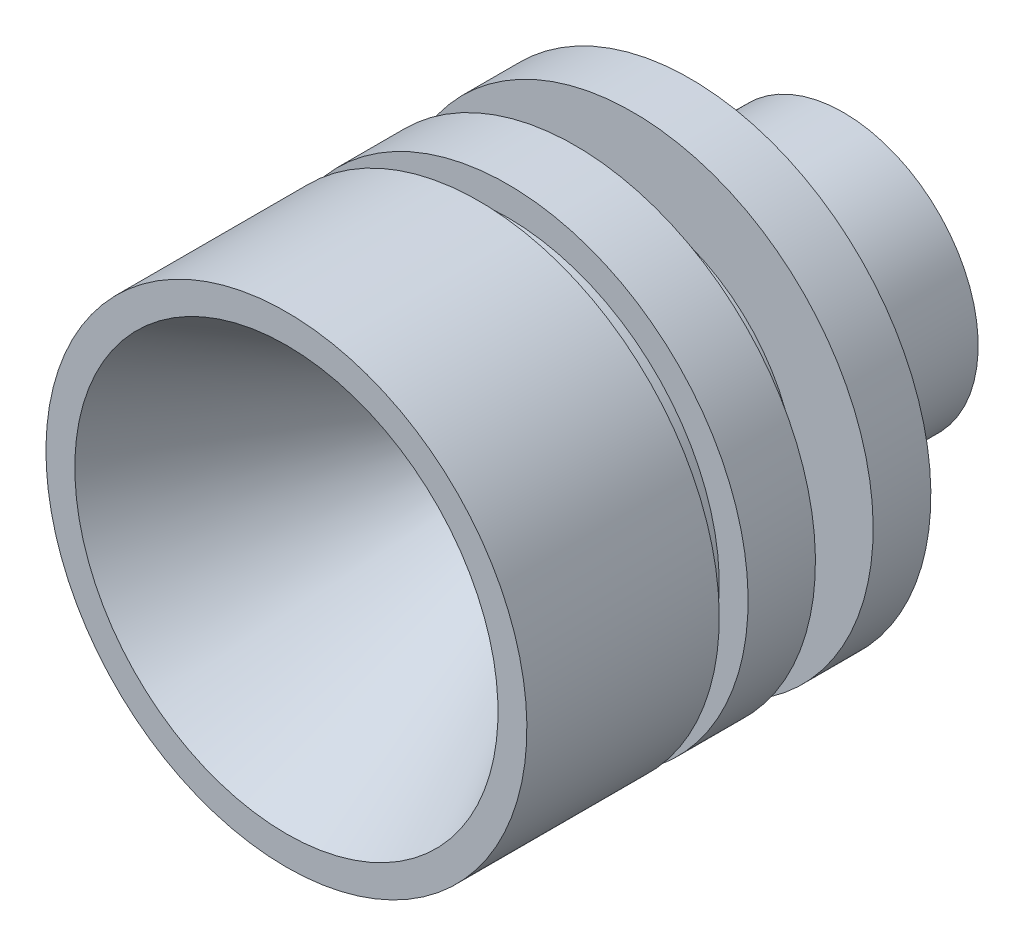
ISO-10303-21;
HEADER;
FILE_DESCRIPTION(('STEP AP214'),'2;1');
FILE_NAME('part.step','',(''),(''),'','','');
FILE_SCHEMA(('AUTOMOTIVE_DESIGN { 1 0 10303 214 1 1 1 1 }'));
ENDSEC;
DATA;
#1=APPLICATION_CONTEXT('core data for automotive mechanical design processes');
#2=APPLICATION_PROTOCOL_DEFINITION('international standard','automotive_design',2000,#1);
#3=PRODUCT_CONTEXT('',#1,'mechanical');
#4=PRODUCT('Part','Part','',(#3));
#5=PRODUCT_RELATED_PRODUCT_CATEGORY('part','',(#4));
#6=PRODUCT_DEFINITION_FORMATION('','',#4);
#7=PRODUCT_DEFINITION_CONTEXT('part definition',#1,'design');
#8=PRODUCT_DEFINITION('design','',#6,#7);
#9=PRODUCT_DEFINITION_SHAPE('','',#8);
#10=(LENGTH_UNIT() NAMED_UNIT(*) SI_UNIT(.MILLI.,.METRE.));
#11=(NAMED_UNIT(*) PLANE_ANGLE_UNIT() SI_UNIT($,.RADIAN.));
#12=(NAMED_UNIT(*) SI_UNIT($,.STERADIAN.) SOLID_ANGLE_UNIT());
#13=UNCERTAINTY_MEASURE_WITH_UNIT(LENGTH_MEASURE(1.E-05),#10,'distance_accuracy_value','');
#14=(GEOMETRIC_REPRESENTATION_CONTEXT(3) GLOBAL_UNCERTAINTY_ASSIGNED_CONTEXT((#13)) GLOBAL_UNIT_ASSIGNED_CONTEXT((#10,
#11,#12)) REPRESENTATION_CONTEXT('',''));
#15=CARTESIAN_POINT('',(0.,0.,0.));
#16=DIRECTION('',(0.,0.,1.));
#17=DIRECTION('',(1.,0.,0.));
#18=AXIS2_PLACEMENT_3D('',#15,#16,#17);
#19=CARTESIAN_POINT('',(0.,12.5,14.4796013855391));
#20=DIRECTION('',(0.,0.,-1.));
#21=DIRECTION('',(0.,1.,0.));
#22=AXIS2_PLACEMENT_3D('',#19,#20,#21);
#23=PLANE('',#22);
#24=CARTESIAN_POINT('',(0.,0.,14.4796013855391));
#25=DIRECTION('',(0.,0.,1.));
#26=DIRECTION('',(0.,-1.,0.));
#27=AXIS2_PLACEMENT_3D('',#24,#25,#26);
#28=CIRCLE('',#27,11.);
#29=CARTESIAN_POINT('',(0.,-11.,14.4796013855391));
#30=VERTEX_POINT('',#29);
#31=EDGE_CURVE('E10',#30,#30,#28,.T.);
#32=ORIENTED_EDGE('',*,*,#31,.F.);
#33=EDGE_LOOP('',(#32));
#34=FACE_BOUND('',#33,.T.);
#35=CARTESIAN_POINT('',(0.,0.,14.4796013855391));
#36=DIRECTION('',(0.,0.,1.));
#37=DIRECTION('',(0.,-1.,0.));
#38=AXIS2_PLACEMENT_3D('',#35,#36,#37);
#39=CIRCLE('',#38,12.5);
#40=CARTESIAN_POINT('',(0.,-12.5,14.4796013855391));
#41=VERTEX_POINT('',#40);
#42=EDGE_CURVE('E81',#41,#41,#39,.T.);
#43=ORIENTED_EDGE('',*,*,#42,.T.);
#44=EDGE_LOOP('',(#43));
#45=FACE_BOUND('',#44,.T.);
#46=ADVANCED_FACE('F32',(#34,#45),#23,.F.);
#47=CARTESIAN_POINT('',(0.,0.,14.4796013855391));
#48=DIRECTION('',(0.,0.,1.));
#49=DIRECTION('',(0.,-1.,0.));
#50=AXIS2_PLACEMENT_3D('',#47,#48,#49);
#51=CONICAL_SURFACE('',#50,11.,0.5235987755983);
#52=CARTESIAN_POINT('',(0.,0.,-1.54186858447295));
#53=DIRECTION('',(0.,0.,1.));
#54=DIRECTION('',(0.,-1.,0.));
#55=AXIS2_PLACEMENT_3D('',#52,#53,#54);
#56=CIRCLE('',#55,1.75);
#57=CARTESIAN_POINT('',(0.,-1.75,-1.54186858447295));
#58=VERTEX_POINT('',#57);
#59=EDGE_CURVE('E38',#58,#58,#56,.T.);
#60=ORIENTED_EDGE('',*,*,#59,.F.);
#61=EDGE_LOOP('',(#60));
#62=FACE_BOUND('',#61,.T.);
#63=ORIENTED_EDGE('',*,*,#31,.T.);
#64=EDGE_LOOP('',(#63));
#65=FACE_BOUND('',#64,.T.);
#66=ADVANCED_FACE('F160',(#62,#65),#51,.F.);
#67=CARTESIAN_POINT('',(0.,0.,-1.54186858447295));
#68=DIRECTION('',(0.,0.,-1.));
#69=DIRECTION('',(0.,1.,0.));
#70=AXIS2_PLACEMENT_3D('',#67,#68,#69);
#71=CONICAL_SURFACE('',#70,1.75,0.209439510239313);
#72=CARTESIAN_POINT('',(0.,0.,-14.4796013855391));
#73=DIRECTION('',(0.,0.,1.));
#74=DIRECTION('',(0.,-1.,0.));
#75=AXIS2_PLACEMENT_3D('',#72,#73,#74);
#76=CIRCLE('',#75,4.5);
#77=CARTESIAN_POINT('',(0.,-4.5,-14.4796013855391));
#78=VERTEX_POINT('',#77);
#79=EDGE_CURVE('E42',#78,#78,#76,.T.);
#80=ORIENTED_EDGE('',*,*,#79,.F.);
#81=EDGE_LOOP('',(#80));
#82=FACE_BOUND('',#81,.T.);
#83=ORIENTED_EDGE('',*,*,#59,.T.);
#84=EDGE_LOOP('',(#83));
#85=FACE_BOUND('',#84,.T.);
#86=ADVANCED_FACE('F155',(#82,#85),#71,.F.);
#87=CARTESIAN_POINT('',(0.,7.,-14.4796013855391));
#88=DIRECTION('',(0.,0.,1.));
#89=DIRECTION('',(0.,-1.,0.));
#90=AXIS2_PLACEMENT_3D('',#87,#88,#89);
#91=PLANE('',#90);
#92=CARTESIAN_POINT('',(0.,0.,-14.4796013855391));
#93=DIRECTION('',(0.,0.,1.));
#94=DIRECTION('',(0.,-1.,0.));
#95=AXIS2_PLACEMENT_3D('',#92,#93,#94);
#96=CIRCLE('',#95,7.);
#97=CARTESIAN_POINT('',(0.,-7.,-14.4796013855391));
#98=VERTEX_POINT('',#97);
#99=EDGE_CURVE('E46',#98,#98,#96,.T.);
#100=ORIENTED_EDGE('',*,*,#99,.F.);
#101=EDGE_LOOP('',(#100));
#102=FACE_BOUND('',#101,.T.);
#103=ORIENTED_EDGE('',*,*,#79,.T.);
#104=EDGE_LOOP('',(#103));
#105=FACE_BOUND('',#104,.T.);
#106=ADVANCED_FACE('F149',(#102,#105),#91,.F.);
#107=CARTESIAN_POINT('',(0.,0.,14.4796013855391));
#108=DIRECTION('',(0.,0.,1.));
#109=DIRECTION('',(0.,-1.,0.));
#110=AXIS2_PLACEMENT_3D('',#107,#108,#109);
#111=CYLINDRICAL_SURFACE('',#110,7.);
#112=CARTESIAN_POINT('',(0.,0.,-6.52039861446088));
#113=DIRECTION('',(0.,0.,1.));
#114=DIRECTION('',(0.,-1.,0.));
#115=AXIS2_PLACEMENT_3D('',#112,#113,#114);
#116=CIRCLE('',#115,7.);
#117=CARTESIAN_POINT('',(0.,-7.,-6.52039861446088));
#118=VERTEX_POINT('',#117);
#119=EDGE_CURVE('E51',#118,#118,#116,.T.);
#120=ORIENTED_EDGE('',*,*,#119,.F.);
#121=EDGE_LOOP('',(#120));
#122=FACE_BOUND('',#121,.T.);
#123=ORIENTED_EDGE('',*,*,#99,.T.);
#124=EDGE_LOOP('',(#123));
#125=FACE_BOUND('',#124,.T.);
#126=ADVANCED_FACE('F143',(#122,#125),#111,.T.);
#127=CARTESIAN_POINT('',(0.,12.5,-6.52039861446088));
#128=DIRECTION('',(0.,0.,1.));
#129=DIRECTION('',(0.,-1.,0.));
#130=AXIS2_PLACEMENT_3D('',#127,#128,#129);
#131=PLANE('',#130);
#132=CARTESIAN_POINT('',(0.,0.,-6.52039861446088));
#133=DIRECTION('',(0.,0.,1.));
#134=DIRECTION('',(0.,-1.,0.));
#135=AXIS2_PLACEMENT_3D('',#132,#133,#134);
#136=CIRCLE('',#135,12.5);
#137=CARTESIAN_POINT('',(0.,-12.5,-6.52039861446088));
#138=VERTEX_POINT('',#137);
#139=EDGE_CURVE('E54',#138,#138,#136,.T.);
#140=ORIENTED_EDGE('',*,*,#139,.F.);
#141=EDGE_LOOP('',(#140));
#142=FACE_BOUND('',#141,.T.);
#143=ORIENTED_EDGE('',*,*,#119,.T.);
#144=EDGE_LOOP('',(#143));
#145=FACE_BOUND('',#144,.T.);
#146=ADVANCED_FACE('F137',(#142,#145),#131,.F.);
#147=CARTESIAN_POINT('',(0.,0.,14.4796013855391));
#148=DIRECTION('',(0.,0.,1.));
#149=DIRECTION('',(0.,-1.,0.));
#150=AXIS2_PLACEMENT_3D('',#147,#148,#149);
#151=CYLINDRICAL_SURFACE('',#150,12.5);
#152=CARTESIAN_POINT('',(0.,0.,-3.52039861446088));
#153=DIRECTION('',(0.,0.,1.));
#154=DIRECTION('',(0.,-1.,0.));
#155=AXIS2_PLACEMENT_3D('',#152,#153,#154);
#156=CIRCLE('',#155,12.5000000000001);
#157=CARTESIAN_POINT('',(0.,-12.5000000000001,-3.52039861446088));
#158=VERTEX_POINT('',#157);
#159=EDGE_CURVE('E57',#158,#158,#156,.T.);
#160=ORIENTED_EDGE('',*,*,#159,.F.);
#161=EDGE_LOOP('',(#160));
#162=FACE_BOUND('',#161,.T.);
#163=ORIENTED_EDGE('',*,*,#139,.T.);
#164=EDGE_LOOP('',(#163));
#165=FACE_BOUND('',#164,.T.);
#166=ADVANCED_FACE('F131',(#162,#165),#151,.T.);
#167=CARTESIAN_POINT('',(0.,8.50000000000006,-3.52039861446088));
#168=DIRECTION('',(0.,0.,-1.));
#169=DIRECTION('',(0.,1.,0.));
#170=AXIS2_PLACEMENT_3D('',#167,#168,#169);
#171=PLANE('',#170);
#172=CARTESIAN_POINT('',(0.,0.,-3.52039861446088));
#173=DIRECTION('',(0.,0.,1.));
#174=DIRECTION('',(0.,-1.,0.));
#175=AXIS2_PLACEMENT_3D('',#172,#173,#174);
#176=CIRCLE('',#175,8.50000000000006);
#177=CARTESIAN_POINT('',(0.,-8.50000000000006,-3.52039861446088));
#178=VERTEX_POINT('',#177);
#179=EDGE_CURVE('E60',#178,#178,#176,.T.);
#180=ORIENTED_EDGE('',*,*,#179,.F.);
#181=EDGE_LOOP('',(#180));
#182=FACE_BOUND('',#181,.T.);
#183=ORIENTED_EDGE('',*,*,#159,.T.);
#184=EDGE_LOOP('',(#183));
#185=FACE_BOUND('',#184,.T.);
#186=ADVANCED_FACE('F125',(#182,#185),#171,.F.);
#187=CARTESIAN_POINT('',(0.,0.,14.4796013855391));
#188=DIRECTION('',(0.,0.,1.));
#189=DIRECTION('',(0.,-1.,0.));
#190=AXIS2_PLACEMENT_3D('',#187,#188,#189);
#191=CYLINDRICAL_SURFACE('',#190,8.50000000000006);
#192=CARTESIAN_POINT('',(0.,0.,-0.520398614460878));
#193=DIRECTION('',(0.,0.,1.));
#194=DIRECTION('',(0.,-1.,0.));
#195=AXIS2_PLACEMENT_3D('',#192,#193,#194);
#196=CIRCLE('',#195,8.50000000000006);
#197=CARTESIAN_POINT('',(0.,-8.50000000000006,-0.520398614460878));
#198=VERTEX_POINT('',#197);
#199=EDGE_CURVE('E63',#198,#198,#196,.T.);
#200=ORIENTED_EDGE('',*,*,#199,.F.);
#201=EDGE_LOOP('',(#200));
#202=FACE_BOUND('',#201,.T.);
#203=ORIENTED_EDGE('',*,*,#179,.T.);
#204=EDGE_LOOP('',(#203));
#205=FACE_BOUND('',#204,.T.);
#206=ADVANCED_FACE('F119',(#202,#205),#191,.T.);
#207=CARTESIAN_POINT('',(0.,12.5,-0.520398614460878));
#208=DIRECTION('',(0.,0.,1.));
#209=DIRECTION('',(0.,-1.,0.));
#210=AXIS2_PLACEMENT_3D('',#207,#208,#209);
#211=PLANE('',#210);
#212=CARTESIAN_POINT('',(0.,0.,-0.520398614460876));
#213=DIRECTION('',(0.,0.,1.));
#214=DIRECTION('',(0.,-1.,0.));
#215=AXIS2_PLACEMENT_3D('',#212,#213,#214);
#216=CIRCLE('',#215,12.5);
#217=CARTESIAN_POINT('',(0.,-12.5,-0.520398614460876));
#218=VERTEX_POINT('',#217);
#219=EDGE_CURVE('E66',#218,#218,#216,.T.);
#220=ORIENTED_EDGE('',*,*,#219,.F.);
#221=EDGE_LOOP('',(#220));
#222=FACE_BOUND('',#221,.T.);
#223=ORIENTED_EDGE('',*,*,#199,.T.);
#224=EDGE_LOOP('',(#223));
#225=FACE_BOUND('',#224,.T.);
#226=ADVANCED_FACE('F113',(#222,#225),#211,.F.);
#227=CARTESIAN_POINT('',(0.,0.,14.4796013855391));
#228=DIRECTION('',(0.,0.,1.));
#229=DIRECTION('',(0.,-1.,0.));
#230=AXIS2_PLACEMENT_3D('',#227,#228,#229);
#231=CYLINDRICAL_SURFACE('',#230,12.5);
#232=CARTESIAN_POINT('',(0.,0.,2.97960138553912));
#233=DIRECTION('',(0.,0.,1.));
#234=DIRECTION('',(0.,-1.,0.));
#235=AXIS2_PLACEMENT_3D('',#232,#233,#234);
#236=CIRCLE('',#235,12.5);
#237=CARTESIAN_POINT('',(0.,-12.5,2.97960138553912));
#238=VERTEX_POINT('',#237);
#239=EDGE_CURVE('E69',#238,#238,#236,.T.);
#240=ORIENTED_EDGE('',*,*,#239,.F.);
#241=EDGE_LOOP('',(#240));
#242=FACE_BOUND('',#241,.T.);
#243=ORIENTED_EDGE('',*,*,#219,.T.);
#244=EDGE_LOOP('',(#243));
#245=FACE_BOUND('',#244,.T.);
#246=ADVANCED_FACE('F107',(#242,#245),#231,.T.);
#247=CARTESIAN_POINT('',(0.,11.,2.97960138553912));
#248=DIRECTION('',(0.,0.,-1.));
#249=DIRECTION('',(0.,1.,0.));
#250=AXIS2_PLACEMENT_3D('',#247,#248,#249);
#251=PLANE('',#250);
#252=CARTESIAN_POINT('',(0.,0.,2.97960138553912));
#253=DIRECTION('',(0.,0.,1.));
#254=DIRECTION('',(0.,-1.,0.));
#255=AXIS2_PLACEMENT_3D('',#252,#253,#254);
#256=CIRCLE('',#255,11.);
#257=CARTESIAN_POINT('',(0.,-11.,2.97960138553912));
#258=VERTEX_POINT('',#257);
#259=EDGE_CURVE('E72',#258,#258,#256,.T.);
#260=ORIENTED_EDGE('',*,*,#259,.F.);
#261=EDGE_LOOP('',(#260));
#262=FACE_BOUND('',#261,.T.);
#263=ORIENTED_EDGE('',*,*,#239,.T.);
#264=EDGE_LOOP('',(#263));
#265=FACE_BOUND('',#264,.T.);
#266=ADVANCED_FACE('F101',(#262,#265),#251,.F.);
#267=CARTESIAN_POINT('',(0.,0.,14.4796013855391));
#268=DIRECTION('',(0.,0.,1.));
#269=DIRECTION('',(0.,-1.,0.));
#270=AXIS2_PLACEMENT_3D('',#267,#268,#269);
#271=CYLINDRICAL_SURFACE('',#270,11.);
#272=CARTESIAN_POINT('',(0.,0.,4.47960138553912));
#273=DIRECTION('',(0.,0.,1.));
#274=DIRECTION('',(0.,-1.,0.));
#275=AXIS2_PLACEMENT_3D('',#272,#273,#274);
#276=CIRCLE('',#275,11.);
#277=CARTESIAN_POINT('',(0.,-11.,4.47960138553912));
#278=VERTEX_POINT('',#277);
#279=EDGE_CURVE('E75',#278,#278,#276,.T.);
#280=ORIENTED_EDGE('',*,*,#279,.F.);
#281=EDGE_LOOP('',(#280));
#282=FACE_BOUND('',#281,.T.);
#283=ORIENTED_EDGE('',*,*,#259,.T.);
#284=EDGE_LOOP('',(#283));
#285=FACE_BOUND('',#284,.T.);
#286=ADVANCED_FACE('F95',(#282,#285),#271,.T.);
#287=CARTESIAN_POINT('',(0.,12.5,4.47960138553912));
#288=DIRECTION('',(0.,0.,1.));
#289=DIRECTION('',(0.,-1.,0.));
#290=AXIS2_PLACEMENT_3D('',#287,#288,#289);
#291=PLANE('',#290);
#292=CARTESIAN_POINT('',(0.,0.,4.47960138553912));
#293=DIRECTION('',(0.,0.,1.));
#294=DIRECTION('',(0.,-1.,0.));
#295=AXIS2_PLACEMENT_3D('',#292,#293,#294);
#296=CIRCLE('',#295,12.5);
#297=CARTESIAN_POINT('',(0.,-12.5,4.47960138553912));
#298=VERTEX_POINT('',#297);
#299=EDGE_CURVE('E78',#298,#298,#296,.T.);
#300=ORIENTED_EDGE('',*,*,#299,.F.);
#301=EDGE_LOOP('',(#300));
#302=FACE_BOUND('',#301,.T.);
#303=ORIENTED_EDGE('',*,*,#279,.T.);
#304=EDGE_LOOP('',(#303));
#305=FACE_BOUND('',#304,.T.);
#306=ADVANCED_FACE('F89',(#302,#305),#291,.F.);
#307=CARTESIAN_POINT('',(0.,0.,14.4796013855391));
#308=DIRECTION('',(0.,0.,1.));
#309=DIRECTION('',(0.,-1.,0.));
#310=AXIS2_PLACEMENT_3D('',#307,#308,#309);
#311=CYLINDRICAL_SURFACE('',#310,12.5);
#312=ORIENTED_EDGE('',*,*,#42,.F.);
#313=EDGE_LOOP('',(#312));
#314=FACE_BOUND('',#313,.T.);
#315=ORIENTED_EDGE('',*,*,#299,.T.);
#316=EDGE_LOOP('',(#315));
#317=FACE_BOUND('',#316,.T.);
#318=ADVANCED_FACE('F86',(#314,#317),#311,.T.);
#319=CLOSED_SHELL('',(#46,#66,#86,#106,#126,#146,#166,#186,#206,#226,#246,#266,#286,#306,#318));
#320=MANIFOLD_SOLID_BREP('B2',#319);
#321=ADVANCED_BREP_SHAPE_REPRESENTATION('',(#18,#320),#14);
#322=SHAPE_DEFINITION_REPRESENTATION(#9,#321);
ENDSEC;
END-ISO-10303-21;
